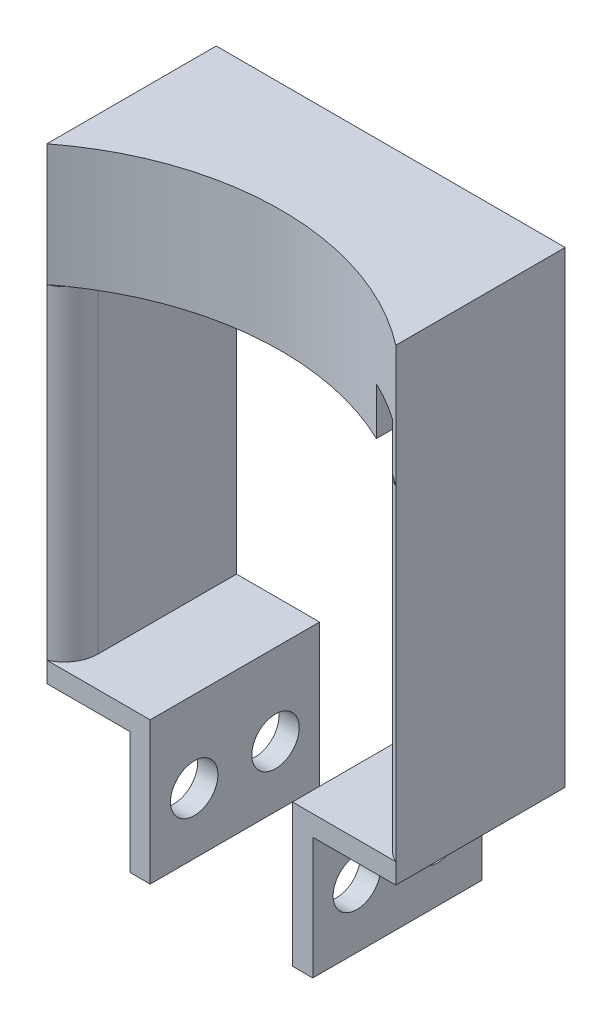
ISO-10303-21;
HEADER;
FILE_DESCRIPTION(('STEP AP214'),'2;1');
FILE_NAME('part.step','',(''),(''),'','','');
FILE_SCHEMA(('AUTOMOTIVE_DESIGN { 1 0 10303 214 1 1 1 1 }'));
ENDSEC;
DATA;
#1=APPLICATION_CONTEXT('core data for automotive mechanical design processes');
#2=APPLICATION_PROTOCOL_DEFINITION('international standard','automotive_design',2000,#1);
#3=PRODUCT_CONTEXT('',#1,'mechanical');
#4=PRODUCT('Part','Part','',(#3));
#5=PRODUCT_RELATED_PRODUCT_CATEGORY('part','',(#4));
#6=PRODUCT_DEFINITION_FORMATION('','',#4);
#7=PRODUCT_DEFINITION_CONTEXT('part definition',#1,'design');
#8=PRODUCT_DEFINITION('design','',#6,#7);
#9=PRODUCT_DEFINITION_SHAPE('','',#8);
#10=(LENGTH_UNIT() NAMED_UNIT(*) SI_UNIT(.MILLI.,.METRE.));
#11=(NAMED_UNIT(*) PLANE_ANGLE_UNIT() SI_UNIT($,.RADIAN.));
#12=(NAMED_UNIT(*) SI_UNIT($,.STERADIAN.) SOLID_ANGLE_UNIT());
#13=UNCERTAINTY_MEASURE_WITH_UNIT(LENGTH_MEASURE(1.E-05),#10,'distance_accuracy_value','');
#14=(GEOMETRIC_REPRESENTATION_CONTEXT(3) GLOBAL_UNCERTAINTY_ASSIGNED_CONTEXT((#13)) GLOBAL_UNIT_ASSIGNED_CONTEXT((#10,
#11,#12)) REPRESENTATION_CONTEXT('',''));
#15=CARTESIAN_POINT('',(0.,0.,0.));
#16=DIRECTION('',(0.,0.,1.));
#17=DIRECTION('',(1.,0.,0.));
#18=AXIS2_PLACEMENT_3D('',#15,#16,#17);
#19=CARTESIAN_POINT('',(0.,0.,25.));
#20=DIRECTION('',(0.,0.,1.));
#21=DIRECTION('',(1.,0.,0.));
#22=AXIS2_PLACEMENT_3D('',#19,#20,#21);
#23=PLANE('',#22);
#24=DIRECTION('',(0.,1.,0.));
#25=VECTOR('',#24,1.);
#26=CARTESIAN_POINT('',(28.,34.,25.));
#27=LINE('',#26,#25);
#28=CARTESIAN_POINT('',(28.,-27.,25.));
#29=VERTEX_POINT('',#28);
#30=CARTESIAN_POINT('',(28.,-24.,25.));
#31=VERTEX_POINT('',#30);
#32=EDGE_CURVE('E229',#29,#31,#27,.T.);
#33=ORIENTED_EDGE('',*,*,#32,.T.);
#34=DIRECTION('',(-1.,0.,0.));
#35=VECTOR('',#34,1.);
#36=CARTESIAN_POINT('',(25.,-24.,25.));
#37=LINE('',#36,#35);
#38=CARTESIAN_POINT('',(12.75,-24.,25.));
#39=VERTEX_POINT('',#38);
#40=EDGE_CURVE('E252',#31,#39,#37,.T.);
#41=ORIENTED_EDGE('',*,*,#40,.T.);
#42=DIRECTION('',(0.,-1.,0.));
#43=VECTOR('',#42,1.);
#44=CARTESIAN_POINT('',(12.75,-45.,25.));
#45=LINE('',#44,#43);
#46=CARTESIAN_POINT('',(12.75,-45.,25.));
#47=VERTEX_POINT('',#46);
#48=EDGE_CURVE('E249',#39,#47,#45,.T.);
#49=ORIENTED_EDGE('',*,*,#48,.T.);
#50=DIRECTION('',(1.,0.,0.));
#51=VECTOR('',#50,1.);
#52=CARTESIAN_POINT('',(15.75,-45.,25.));
#53=LINE('',#52,#51);
#54=CARTESIAN_POINT('',(15.75,-45.,25.));
#55=VERTEX_POINT('',#54);
#56=EDGE_CURVE('E246',#47,#55,#53,.T.);
#57=ORIENTED_EDGE('',*,*,#56,.T.);
#58=DIRECTION('',(0.,1.,0.));
#59=VECTOR('',#58,1.);
#60=CARTESIAN_POINT('',(15.75,-27.,25.));
#61=LINE('',#60,#59);
#62=CARTESIAN_POINT('',(15.75,-27.,25.));
#63=VERTEX_POINT('',#62);
#64=EDGE_CURVE('E243',#55,#63,#61,.T.);
#65=ORIENTED_EDGE('',*,*,#64,.T.);
#66=DIRECTION('',(1.,0.,0.));
#67=VECTOR('',#66,1.);
#68=CARTESIAN_POINT('',(28.,-27.,25.));
#69=LINE('',#68,#67);
#70=EDGE_CURVE('E239',#63,#29,#69,.T.);
#71=ORIENTED_EDGE('',*,*,#70,.T.);
#72=EDGE_LOOP('',(#33,#41,#49,#57,#65,#71));
#73=FACE_BOUND('',#72,.T.);
#74=ADVANCED_FACE('F45',(#73),#23,.T.);
#75=DIRECTION('',(-1.,0.,0.));
#76=VECTOR('',#75,1.);
#77=CARTESIAN_POINT('',(-20.5,-24.,25.));
#78=LINE('',#77,#76);
#79=CARTESIAN_POINT('',(-8.25,-24.,25.));
#80=VERTEX_POINT('',#79);
#81=CARTESIAN_POINT('',(-23.5,-24.,25.));
#82=VERTEX_POINT('',#81);
#83=EDGE_CURVE('E350',#80,#82,#78,.T.);
#84=ORIENTED_EDGE('',*,*,#83,.T.);
#85=DIRECTION('',(0.,-1.,0.));
#86=VECTOR('',#85,1.);
#87=CARTESIAN_POINT('',(-23.5,27.,25.));
#88=LINE('',#87,#86);
#89=CARTESIAN_POINT('',(-23.5,-27.,25.));
#90=VERTEX_POINT('',#89);
#91=EDGE_CURVE('E222',#82,#90,#88,.T.);
#92=ORIENTED_EDGE('',*,*,#91,.T.);
#93=DIRECTION('',(1.,0.,0.));
#94=VECTOR('',#93,1.);
#95=CARTESIAN_POINT('',(-23.5,-27.,25.));
#96=LINE('',#95,#94);
#97=CARTESIAN_POINT('',(-11.25,-27.,25.));
#98=VERTEX_POINT('',#97);
#99=EDGE_CURVE('E220',#90,#98,#96,.T.);
#100=ORIENTED_EDGE('',*,*,#99,.T.);
#101=DIRECTION('',(0.,-1.,0.));
#102=VECTOR('',#101,1.);
#103=CARTESIAN_POINT('',(-11.25,-27.,25.));
#104=LINE('',#103,#102);
#105=CARTESIAN_POINT('',(-11.25,-45.,25.));
#106=VERTEX_POINT('',#105);
#107=EDGE_CURVE('E225',#98,#106,#104,.T.);
#108=ORIENTED_EDGE('',*,*,#107,.T.);
#109=DIRECTION('',(1.,0.,0.));
#110=VECTOR('',#109,1.);
#111=CARTESIAN_POINT('',(-11.25,-45.,25.));
#112=LINE('',#111,#110);
#113=CARTESIAN_POINT('',(-8.25,-45.,25.));
#114=VERTEX_POINT('',#113);
#115=EDGE_CURVE('E367',#106,#114,#112,.T.);
#116=ORIENTED_EDGE('',*,*,#115,.T.);
#117=DIRECTION('',(0.,1.,0.));
#118=VECTOR('',#117,1.);
#119=CARTESIAN_POINT('',(-8.25,-24.,25.));
#120=LINE('',#119,#118);
#121=EDGE_CURVE('E386',#114,#80,#120,.T.);
#122=ORIENTED_EDGE('',*,*,#121,.T.);
#123=EDGE_LOOP('',(#84,#92,#100,#108,#116,#122));
#124=FACE_BOUND('',#123,.T.);
#125=ADVANCED_FACE('F364',(#124),#23,.T.);
#126=CARTESIAN_POINT('',(-20.5,24.,25.));
#127=DIRECTION('',(-1.,0.,0.));
#128=DIRECTION('',(0.,0.,1.));
#129=AXIS2_PLACEMENT_3D('',#126,#127,#128);
#130=PLANE('',#129);
#131=DIRECTION('',(0.,0.,-1.));
#132=VECTOR('',#131,1.);
#133=CARTESIAN_POINT('',(-20.5,24.,25.));
#134=LINE('',#133,#132);
#135=CARTESIAN_POINT('',(-20.5,24.,20.4174243050442));
#136=VERTEX_POINT('',#135);
#137=CARTESIAN_POINT('',(-20.5,24.,0.));
#138=VERTEX_POINT('',#137);
#139=EDGE_CURVE('E334',#136,#138,#134,.T.);
#140=ORIENTED_EDGE('',*,*,#139,.F.);
#141=DIRECTION('',(0.,1.,0.));
#142=VECTOR('',#141,1.);
#143=CARTESIAN_POINT('',(-20.5,24.,20.4174243050442));
#144=LINE('',#143,#142);
#145=CARTESIAN_POINT('',(-20.5,-24.,20.4174243050442));
#146=VERTEX_POINT('',#145);
#147=EDGE_CURVE('E62',#136,#146,#144,.F.);
#148=ORIENTED_EDGE('',*,*,#147,.T.);
#149=DIRECTION('',(0.,0.,-1.));
#150=VECTOR('',#149,1.);
#151=CARTESIAN_POINT('',(-20.5,-24.,25.));
#152=LINE('',#151,#150);
#153=CARTESIAN_POINT('',(-20.5,-24.,0.));
#154=VERTEX_POINT('',#153);
#155=EDGE_CURVE('E351',#146,#154,#152,.T.);
#156=ORIENTED_EDGE('',*,*,#155,.T.);
#157=DIRECTION('',(0.,1.,0.));
#158=VECTOR('',#157,1.);
#159=CARTESIAN_POINT('',(-20.5,24.,0.));
#160=LINE('',#159,#158);
#161=EDGE_CURVE('E260',#154,#138,#160,.T.);
#162=ORIENTED_EDGE('',*,*,#161,.T.);
#163=EDGE_LOOP('',(#140,#148,#156,#162));
#164=FACE_BOUND('',#163,.T.);
#165=ADVANCED_FACE('F339',(#164),#130,.F.);
#166=CARTESIAN_POINT('',(-20.5,24.,25.));
#167=DIRECTION('',(0.,1.,0.));
#168=DIRECTION('',(0.,0.,1.));
#169=AXIS2_PLACEMENT_3D('',#166,#167,#168);
#170=PLANE('',#169);
#171=DIRECTION('',(0.,0.,-1.));
#172=VECTOR('',#171,1.);
#173=CARTESIAN_POINT('',(20.5,24.,25.));
#174=LINE('',#173,#172);
#175=CARTESIAN_POINT('',(20.5,24.,20.3526437034143));
#176=VERTEX_POINT('',#175);
#177=CARTESIAN_POINT('',(20.5,24.,0.));
#178=VERTEX_POINT('',#177);
#179=EDGE_CURVE('E342',#176,#178,#174,.T.);
#180=ORIENTED_EDGE('',*,*,#179,.F.);
#181=CARTESIAN_POINT('',(2.25,24.,58.1803782377477));
#182=DIRECTION('',(0.,1.,0.));
#183=DIRECTION('',(0.,0.,1.));
#184=AXIS2_PLACEMENT_3D('',#181,#182,#183);
#185=CIRCLE('',#184,42.);
#186=CARTESIAN_POINT('',(-21.7240357492382,24.,23.694937688231));
#187=VERTEX_POINT('',#186);
#188=EDGE_CURVE('E296',#187,#176,#185,.F.);
#189=ORIENTED_EDGE('',*,*,#188,.F.);
#190=CARTESIAN_POINT('',(-25.5,24.,20.4174243050442));
#191=DIRECTION('',(0.,1.,0.));
#192=DIRECTION('',(0.,0.,1.));
#193=AXIS2_PLACEMENT_3D('',#190,#191,#192);
#194=CIRCLE('',#193,5.);
#195=EDGE_CURVE('E55',#187,#136,#194,.T.);
#196=ORIENTED_EDGE('',*,*,#195,.T.);
#197=ORIENTED_EDGE('',*,*,#139,.T.);
#198=DIRECTION('',(1.,0.,0.));
#199=VECTOR('',#198,1.);
#200=CARTESIAN_POINT('',(-20.5,24.,0.));
#201=LINE('',#200,#199);
#202=EDGE_CURVE('E395',#138,#178,#201,.T.);
#203=ORIENTED_EDGE('',*,*,#202,.T.);
#204=EDGE_LOOP('',(#180,#189,#196,#197,#203));
#205=FACE_BOUND('',#204,.T.);
#206=ADVANCED_FACE('F332',(#205),#170,.F.);
#207=CARTESIAN_POINT('',(20.5,24.,25.));
#208=DIRECTION('',(-1.,0.,0.));
#209=DIRECTION('',(0.,0.,1.));
#210=AXIS2_PLACEMENT_3D('',#207,#208,#209);
#211=PLANE('',#210);
#212=DIRECTION('',(0.,0.,-1.));
#213=VECTOR('',#212,1.);
#214=CARTESIAN_POINT('',(20.5,31.,25.));
#215=LINE('',#214,#213);
#216=CARTESIAN_POINT('',(20.5,31.,20.3526437034143));
#217=VERTEX_POINT('',#216);
#218=CARTESIAN_POINT('',(20.5,31.,0.));
#219=VERTEX_POINT('',#218);
#220=EDGE_CURVE('E483',#217,#219,#215,.T.);
#221=ORIENTED_EDGE('',*,*,#220,.F.);
#222=DIRECTION('',(0.,1.,0.));
#223=VECTOR('',#222,1.);
#224=CARTESIAN_POINT('',(20.5,-28.2497438082637,20.3526437034143));
#225=LINE('',#224,#223);
#226=EDGE_CURVE('E280',#217,#176,#225,.F.);
#227=ORIENTED_EDGE('',*,*,#226,.T.);
#228=ORIENTED_EDGE('',*,*,#179,.T.);
#229=DIRECTION('',(0.,1.,0.));
#230=VECTOR('',#229,1.);
#231=CARTESIAN_POINT('',(20.5,24.,0.));
#232=LINE('',#231,#230);
#233=EDGE_CURVE('E398',#178,#219,#232,.T.);
#234=ORIENTED_EDGE('',*,*,#233,.T.);
#235=EDGE_LOOP('',(#221,#227,#228,#234));
#236=FACE_BOUND('',#235,.T.);
#237=ADVANCED_FACE('F570',(#236),#211,.F.);
#238=CARTESIAN_POINT('',(20.5,31.,25.));
#239=DIRECTION('',(0.,1.,0.));
#240=DIRECTION('',(0.,0.,1.));
#241=AXIS2_PLACEMENT_3D('',#238,#239,#240);
#242=PLANE('',#241);
#243=DIRECTION('',(0.,0.,-1.));
#244=VECTOR('',#243,1.);
#245=CARTESIAN_POINT('',(25.,31.,25.));
#246=LINE('',#245,#244);
#247=CARTESIAN_POINT('',(25.,31.,20.4174243050442));
#248=VERTEX_POINT('',#247);
#249=CARTESIAN_POINT('',(25.,31.,0.));
#250=VERTEX_POINT('',#249);
#251=EDGE_CURVE('E480',#248,#250,#246,.T.);
#252=ORIENTED_EDGE('',*,*,#251,.F.);
#253=CARTESIAN_POINT('',(30.,31.,20.4174243050442));
#254=DIRECTION('',(0.,1.,0.));
#255=DIRECTION('',(0.,0.,1.));
#256=AXIS2_PLACEMENT_3D('',#253,#254,#255);
#257=CIRCLE('',#256,5.);
#258=CARTESIAN_POINT('',(26.2240357492382,31.,23.694937688231));
#259=VERTEX_POINT('',#258);
#260=EDGE_CURVE('E319',#248,#259,#257,.T.);
#261=ORIENTED_EDGE('',*,*,#260,.T.);
#262=CARTESIAN_POINT('',(2.25,31.,58.1803782377477));
#263=DIRECTION('',(0.,1.,0.));
#264=DIRECTION('',(0.,0.,1.));
#265=AXIS2_PLACEMENT_3D('',#262,#263,#264);
#266=CIRCLE('',#265,42.);
#267=EDGE_CURVE('E287',#259,#217,#266,.T.);
#268=ORIENTED_EDGE('',*,*,#267,.T.);
#269=ORIENTED_EDGE('',*,*,#220,.T.);
#270=DIRECTION('',(1.,0.,0.));
#271=VECTOR('',#270,1.);
#272=CARTESIAN_POINT('',(20.5,31.,0.));
#273=LINE('',#272,#271);
#274=EDGE_CURVE('E402',#219,#250,#273,.T.);
#275=ORIENTED_EDGE('',*,*,#274,.T.);
#276=EDGE_LOOP('',(#252,#261,#268,#269,#275));
#277=FACE_BOUND('',#276,.T.);
#278=ADVANCED_FACE('F566',(#277),#242,.F.);
#279=CARTESIAN_POINT('',(25.,31.,25.));
#280=DIRECTION('',(1.,0.,0.));
#281=DIRECTION('',(0.,0.,-1.));
#282=AXIS2_PLACEMENT_3D('',#279,#280,#281);
#283=PLANE('',#282);
#284=DIRECTION('',(0.,0.,-1.));
#285=VECTOR('',#284,1.);
#286=CARTESIAN_POINT('',(25.,-24.,25.));
#287=LINE('',#286,#285);
#288=CARTESIAN_POINT('',(25.,-24.,20.4174243050442));
#289=VERTEX_POINT('',#288);
#290=CARTESIAN_POINT('',(25.,-24.,0.));
#291=VERTEX_POINT('',#290);
#292=EDGE_CURVE('E477',#289,#291,#287,.T.);
#293=ORIENTED_EDGE('',*,*,#292,.F.);
#294=DIRECTION('',(0.,-1.,0.));
#295=VECTOR('',#294,1.);
#296=CARTESIAN_POINT('',(25.,31.,20.4174243050442));
#297=LINE('',#296,#295);
#298=EDGE_CURVE('E315',#289,#248,#297,.F.);
#299=ORIENTED_EDGE('',*,*,#298,.T.);
#300=ORIENTED_EDGE('',*,*,#251,.T.);
#301=DIRECTION('',(0.,-1.,0.));
#302=VECTOR('',#301,1.);
#303=CARTESIAN_POINT('',(25.,31.,0.));
#304=LINE('',#303,#302);
#305=EDGE_CURVE('E406',#250,#291,#304,.T.);
#306=ORIENTED_EDGE('',*,*,#305,.T.);
#307=EDGE_LOOP('',(#293,#299,#300,#306));
#308=FACE_BOUND('',#307,.T.);
#309=ADVANCED_FACE('F563',(#308),#283,.F.);
#310=CARTESIAN_POINT('',(25.,-24.,25.));
#311=DIRECTION('',(0.,-1.,0.));
#312=DIRECTION('',(0.,0.,-1.));
#313=AXIS2_PLACEMENT_3D('',#310,#311,#312);
#314=PLANE('',#313);
#315=DIRECTION('',(-1.,0.,0.));
#316=VECTOR('',#315,1.);
#317=CARTESIAN_POINT('',(25.,-24.,0.));
#318=LINE('',#317,#316);
#319=CARTESIAN_POINT('',(12.75,-24.,0.));
#320=VERTEX_POINT('',#319);
#321=EDGE_CURVE('E410',#291,#320,#318,.T.);
#322=ORIENTED_EDGE('',*,*,#321,.T.);
#323=DIRECTION('',(0.,0.,-1.));
#324=VECTOR('',#323,1.);
#325=CARTESIAN_POINT('',(12.75,-24.,25.));
#326=LINE('',#325,#324);
#327=EDGE_CURVE('E473',#39,#320,#326,.T.);
#328=ORIENTED_EDGE('',*,*,#327,.F.);
#329=ORIENTED_EDGE('',*,*,#40,.F.);
#330=CARTESIAN_POINT('',(30.,-24.,20.4174243050442));
#331=DIRECTION('',(0.,-1.,0.));
#332=DIRECTION('',(0.,0.,-1.));
#333=AXIS2_PLACEMENT_3D('',#330,#331,#332);
#334=CIRCLE('',#333,5.);
#335=EDGE_CURVE('E314',#31,#289,#334,.T.);
#336=ORIENTED_EDGE('',*,*,#335,.T.);
#337=ORIENTED_EDGE('',*,*,#292,.T.);
#338=EDGE_LOOP('',(#322,#328,#329,#336,#337));
#339=FACE_BOUND('',#338,.T.);
#340=ADVANCED_FACE('F559',(#339),#314,.F.);
#341=CARTESIAN_POINT('',(12.75,-45.,25.));
#342=DIRECTION('',(1.,0.,0.));
#343=DIRECTION('',(0.,0.,-1.));
#344=AXIS2_PLACEMENT_3D('',#341,#342,#343);
#345=PLANE('',#344);
#346=CARTESIAN_POINT('',(12.75,-36.,6.5));
#347=DIRECTION('',(1.,0.,0.));
#348=DIRECTION('',(0.,0.,-1.));
#349=AXIS2_PLACEMENT_3D('',#346,#347,#348);
#350=CIRCLE('',#349,3.5);
#351=CARTESIAN_POINT('',(12.75,-36.,3.));
#352=VERTEX_POINT('',#351);
#353=EDGE_CURVE('E256',#352,#352,#350,.F.);
#354=ORIENTED_EDGE('',*,*,#353,.F.);
#355=EDGE_LOOP('',(#354));
#356=FACE_BOUND('',#355,.T.);
#357=CARTESIAN_POINT('',(12.75,-36.,18.5));
#358=DIRECTION('',(1.,0.,0.));
#359=DIRECTION('',(0.,0.,-1.));
#360=AXIS2_PLACEMENT_3D('',#357,#358,#359);
#361=CIRCLE('',#360,3.5);
#362=CARTESIAN_POINT('',(12.75,-36.,15.));
#363=VERTEX_POINT('',#362);
#364=EDGE_CURVE('E266',#363,#363,#361,.F.);
#365=ORIENTED_EDGE('',*,*,#364,.F.);
#366=EDGE_LOOP('',(#365));
#367=FACE_BOUND('',#366,.T.);
#368=DIRECTION('',(0.,-1.,0.));
#369=VECTOR('',#368,1.);
#370=CARTESIAN_POINT('',(12.75,-45.,0.));
#371=LINE('',#370,#369);
#372=CARTESIAN_POINT('',(12.75,-45.,0.));
#373=VERTEX_POINT('',#372);
#374=EDGE_CURVE('E413',#320,#373,#371,.T.);
#375=ORIENTED_EDGE('',*,*,#374,.T.);
#376=DIRECTION('',(0.,0.,-1.));
#377=VECTOR('',#376,1.);
#378=CARTESIAN_POINT('',(12.75,-45.,25.));
#379=LINE('',#378,#377);
#380=EDGE_CURVE('E469',#47,#373,#379,.T.);
#381=ORIENTED_EDGE('',*,*,#380,.F.);
#382=ORIENTED_EDGE('',*,*,#48,.F.);
#383=ORIENTED_EDGE('',*,*,#327,.T.);
#384=EDGE_LOOP('',(#375,#381,#382,#383));
#385=FACE_BOUND('',#384,.T.);
#386=ADVANCED_FACE('F555',(#356,#367,#385),#345,.F.);
#387=CARTESIAN_POINT('',(15.75,-45.,25.));
#388=DIRECTION('',(0.,1.,0.));
#389=DIRECTION('',(0.,0.,1.));
#390=AXIS2_PLACEMENT_3D('',#387,#388,#389);
#391=PLANE('',#390);
#392=DIRECTION('',(1.,0.,0.));
#393=VECTOR('',#392,1.);
#394=CARTESIAN_POINT('',(15.75,-45.,0.));
#395=LINE('',#394,#393);
#396=CARTESIAN_POINT('',(15.75,-45.,0.));
#397=VERTEX_POINT('',#396);
#398=EDGE_CURVE('E416',#373,#397,#395,.T.);
#399=ORIENTED_EDGE('',*,*,#398,.T.);
#400=DIRECTION('',(0.,0.,-1.));
#401=VECTOR('',#400,1.);
#402=CARTESIAN_POINT('',(15.75,-45.,25.));
#403=LINE('',#402,#401);
#404=EDGE_CURVE('E465',#55,#397,#403,.T.);
#405=ORIENTED_EDGE('',*,*,#404,.F.);
#406=ORIENTED_EDGE('',*,*,#56,.F.);
#407=ORIENTED_EDGE('',*,*,#380,.T.);
#408=EDGE_LOOP('',(#399,#405,#406,#407));
#409=FACE_BOUND('',#408,.T.);
#410=ADVANCED_FACE('F551',(#409),#391,.F.);
#411=CARTESIAN_POINT('',(15.75,-27.,25.));
#412=DIRECTION('',(-1.,0.,0.));
#413=DIRECTION('',(0.,0.,1.));
#414=AXIS2_PLACEMENT_3D('',#411,#412,#413);
#415=PLANE('',#414);
#416=CARTESIAN_POINT('',(15.75,-36.,6.5));
#417=DIRECTION('',(-1.,0.,0.));
#418=DIRECTION('',(0.,0.,1.));
#419=AXIS2_PLACEMENT_3D('',#416,#417,#418);
#420=CIRCLE('',#419,3.5);
#421=CARTESIAN_POINT('',(15.75,-36.,10.));
#422=VERTEX_POINT('',#421);
#423=EDGE_CURVE('E261',#422,#422,#420,.F.);
#424=ORIENTED_EDGE('',*,*,#423,.F.);
#425=EDGE_LOOP('',(#424));
#426=FACE_BOUND('',#425,.T.);
#427=CARTESIAN_POINT('',(15.75,-36.,18.5));
#428=DIRECTION('',(-1.,0.,0.));
#429=DIRECTION('',(0.,0.,1.));
#430=AXIS2_PLACEMENT_3D('',#427,#428,#429);
#431=CIRCLE('',#430,3.5);
#432=CARTESIAN_POINT('',(15.75,-36.,22.));
#433=VERTEX_POINT('',#432);
#434=EDGE_CURVE('E270',#433,#433,#431,.F.);
#435=ORIENTED_EDGE('',*,*,#434,.F.);
#436=EDGE_LOOP('',(#435));
#437=FACE_BOUND('',#436,.T.);
#438=DIRECTION('',(0.,1.,0.));
#439=VECTOR('',#438,1.);
#440=CARTESIAN_POINT('',(15.75,-27.,0.));
#441=LINE('',#440,#439);
#442=CARTESIAN_POINT('',(15.75,-27.,0.));
#443=VERTEX_POINT('',#442);
#444=EDGE_CURVE('E419',#397,#443,#441,.T.);
#445=ORIENTED_EDGE('',*,*,#444,.T.);
#446=DIRECTION('',(0.,0.,-1.));
#447=VECTOR('',#446,1.);
#448=CARTESIAN_POINT('',(15.75,-27.,25.));
#449=LINE('',#448,#447);
#450=EDGE_CURVE('E461',#63,#443,#449,.T.);
#451=ORIENTED_EDGE('',*,*,#450,.F.);
#452=ORIENTED_EDGE('',*,*,#64,.F.);
#453=ORIENTED_EDGE('',*,*,#404,.T.);
#454=EDGE_LOOP('',(#445,#451,#452,#453));
#455=FACE_BOUND('',#454,.T.);
#456=ADVANCED_FACE('F547',(#426,#437,#455),#415,.F.);
#457=CARTESIAN_POINT('',(28.,-27.,25.));
#458=DIRECTION('',(0.,1.,0.));
#459=DIRECTION('',(0.,0.,1.));
#460=AXIS2_PLACEMENT_3D('',#457,#458,#459);
#461=PLANE('',#460);
#462=DIRECTION('',(1.,0.,0.));
#463=VECTOR('',#462,1.);
#464=CARTESIAN_POINT('',(28.,-27.,0.));
#465=LINE('',#464,#463);
#466=CARTESIAN_POINT('',(28.,-27.,0.));
#467=VERTEX_POINT('',#466);
#468=EDGE_CURVE('E422',#443,#467,#465,.T.);
#469=ORIENTED_EDGE('',*,*,#468,.T.);
#470=DIRECTION('',(0.,0.,-1.));
#471=VECTOR('',#470,1.);
#472=CARTESIAN_POINT('',(28.,-27.,25.));
#473=LINE('',#472,#471);
#474=EDGE_CURVE('E457',#29,#467,#473,.T.);
#475=ORIENTED_EDGE('',*,*,#474,.F.);
#476=ORIENTED_EDGE('',*,*,#70,.F.);
#477=ORIENTED_EDGE('',*,*,#450,.T.);
#478=EDGE_LOOP('',(#469,#475,#476,#477));
#479=FACE_BOUND('',#478,.T.);
#480=ADVANCED_FACE('F544',(#479),#461,.F.);
#481=CARTESIAN_POINT('',(28.,42.,25.));
#482=DIRECTION('',(-1.,0.,0.));
#483=DIRECTION('',(0.,0.,1.));
#484=AXIS2_PLACEMENT_3D('',#481,#482,#483);
#485=PLANE('',#484);
#486=DIRECTION('',(0.,1.,0.));
#487=VECTOR('',#486,1.);
#488=CARTESIAN_POINT('',(28.,42.,0.));
#489=LINE('',#488,#487);
#490=CARTESIAN_POINT('',(28.,42.,0.));
#491=VERTEX_POINT('',#490);
#492=EDGE_CURVE('E426',#467,#491,#489,.T.);
#493=ORIENTED_EDGE('',*,*,#492,.T.);
#494=DIRECTION('',(0.,0.,-1.));
#495=VECTOR('',#494,1.);
#496=CARTESIAN_POINT('',(28.,42.,25.));
#497=LINE('',#496,#495);
#498=CARTESIAN_POINT('',(28.,42.,25.));
#499=VERTEX_POINT('',#498);
#500=EDGE_CURVE('E211',#499,#491,#497,.T.);
#501=ORIENTED_EDGE('',*,*,#500,.F.);
#502=DIRECTION('',(0.,1.,0.));
#503=VECTOR('',#502,1.);
#504=CARTESIAN_POINT('',(28.,-28.2497438082637,25.));
#505=LINE('',#504,#503);
#506=CARTESIAN_POINT('',(28.,24.,25.));
#507=VERTEX_POINT('',#506);
#508=EDGE_CURVE('E197',#507,#499,#505,.T.);
#509=ORIENTED_EDGE('',*,*,#508,.F.);
#510=EDGE_CURVE('E234',#31,#507,#27,.T.);
#511=ORIENTED_EDGE('',*,*,#510,.F.);
#512=ORIENTED_EDGE('',*,*,#32,.F.);
#513=ORIENTED_EDGE('',*,*,#474,.T.);
#514=EDGE_LOOP('',(#493,#501,#509,#511,#512,#513));
#515=FACE_BOUND('',#514,.T.);
#516=ADVANCED_FACE('F307',(#515),#485,.F.);
#517=CARTESIAN_POINT('',(-23.5,42.,25.));
#518=DIRECTION('',(0.,-1.,0.));
#519=DIRECTION('',(0.,0.,-1.));
#520=AXIS2_PLACEMENT_3D('',#517,#518,#519);
#521=PLANE('',#520);
#522=DIRECTION('',(0.,0.,-1.));
#523=VECTOR('',#522,1.);
#524=CARTESIAN_POINT('',(-23.5,42.,25.));
#525=LINE('',#524,#523);
#526=CARTESIAN_POINT('',(-23.5,42.,25.));
#527=VERTEX_POINT('',#526);
#528=CARTESIAN_POINT('',(-23.5,42.,0.));
#529=VERTEX_POINT('',#528);
#530=EDGE_CURVE('E205',#527,#529,#525,.T.);
#531=ORIENTED_EDGE('',*,*,#530,.F.);
#532=CARTESIAN_POINT('',(2.25,42.,58.1803782377477));
#533=DIRECTION('',(0.,1.,0.));
#534=DIRECTION('',(0.,0.,-1.));
#535=AXIS2_PLACEMENT_3D('',#532,#533,#534);
#536=CIRCLE('',#535,42.);
#537=EDGE_CURVE('E188',#499,#527,#536,.T.);
#538=ORIENTED_EDGE('',*,*,#537,.F.);
#539=ORIENTED_EDGE('',*,*,#500,.T.);
#540=DIRECTION('',(-1.,0.,0.));
#541=VECTOR('',#540,1.);
#542=CARTESIAN_POINT('',(-23.5,42.,0.));
#543=LINE('',#542,#541);
#544=EDGE_CURVE('E208',#491,#529,#543,.T.);
#545=ORIENTED_EDGE('',*,*,#544,.T.);
#546=EDGE_LOOP('',(#531,#538,#539,#545));
#547=FACE_BOUND('',#546,.T.);
#548=ADVANCED_FACE('F206',(#547),#521,.F.);
#549=CARTESIAN_POINT('',(-23.5,27.,25.));
#550=DIRECTION('',(1.,0.,0.));
#551=DIRECTION('',(0.,0.,-1.));
#552=AXIS2_PLACEMENT_3D('',#549,#550,#551);
#553=PLANE('',#552);
#554=DIRECTION('',(0.,-1.,0.));
#555=VECTOR('',#554,1.);
#556=CARTESIAN_POINT('',(-23.5,27.,0.));
#557=LINE('',#556,#555);
#558=CARTESIAN_POINT('',(-23.5,-27.,0.));
#559=VERTEX_POINT('',#558);
#560=EDGE_CURVE('E354',#529,#559,#557,.T.);
#561=ORIENTED_EDGE('',*,*,#560,.T.);
#562=DIRECTION('',(0.,0.,-1.));
#563=VECTOR('',#562,1.);
#564=CARTESIAN_POINT('',(-23.5,-27.,25.));
#565=LINE('',#564,#563);
#566=EDGE_CURVE('E212',#90,#559,#565,.T.);
#567=ORIENTED_EDGE('',*,*,#566,.F.);
#568=ORIENTED_EDGE('',*,*,#91,.F.);
#569=CARTESIAN_POINT('',(-23.5,24.,25.));
#570=VERTEX_POINT('',#569);
#571=EDGE_CURVE('E218',#570,#82,#88,.T.);
#572=ORIENTED_EDGE('',*,*,#571,.F.);
#573=EDGE_CURVE('E193',#527,#570,#88,.T.);
#574=ORIENTED_EDGE('',*,*,#573,.F.);
#575=ORIENTED_EDGE('',*,*,#530,.T.);
#576=EDGE_LOOP('',(#561,#567,#568,#572,#574,#575));
#577=FACE_BOUND('',#576,.T.);
#578=ADVANCED_FACE('F215',(#577),#553,.F.);
#579=CARTESIAN_POINT('',(-23.5,-27.,25.));
#580=DIRECTION('',(0.,1.,0.));
#581=DIRECTION('',(-1.,0.,0.));
#582=AXIS2_PLACEMENT_3D('',#579,#580,#581);
#583=PLANE('',#582);
#584=DIRECTION('',(1.,0.,0.));
#585=VECTOR('',#584,1.);
#586=CARTESIAN_POINT('',(-23.5,-27.,0.));
#587=LINE('',#586,#585);
#588=CARTESIAN_POINT('',(-11.25,-27.,0.));
#589=VERTEX_POINT('',#588);
#590=EDGE_CURVE('E433',#559,#589,#587,.T.);
#591=ORIENTED_EDGE('',*,*,#590,.T.);
#592=DIRECTION('',(0.,0.,-1.));
#593=VECTOR('',#592,1.);
#594=CARTESIAN_POINT('',(-11.25,-27.,25.));
#595=LINE('',#594,#593);
#596=EDGE_CURVE('E358',#98,#589,#595,.T.);
#597=ORIENTED_EDGE('',*,*,#596,.F.);
#598=ORIENTED_EDGE('',*,*,#99,.F.);
#599=ORIENTED_EDGE('',*,*,#566,.T.);
#600=EDGE_LOOP('',(#591,#597,#598,#599));
#601=FACE_BOUND('',#600,.T.);
#602=ADVANCED_FACE('F361',(#601),#583,.F.);
#603=CARTESIAN_POINT('',(-11.25,-27.,25.));
#604=DIRECTION('',(1.,0.,0.));
#605=DIRECTION('',(0.,0.,-1.));
#606=AXIS2_PLACEMENT_3D('',#603,#604,#605);
#607=PLANE('',#606);
#608=CARTESIAN_POINT('',(-11.25,-36.,6.5));
#609=DIRECTION('',(1.,0.,0.));
#610=DIRECTION('',(0.,0.,-1.));
#611=AXIS2_PLACEMENT_3D('',#608,#609,#610);
#612=CIRCLE('',#611,3.5);
#613=CARTESIAN_POINT('',(-11.25,-36.,3.));
#614=VERTEX_POINT('',#613);
#615=EDGE_CURVE('E279',#614,#614,#612,.T.);
#616=ORIENTED_EDGE('',*,*,#615,.T.);
#617=EDGE_LOOP('',(#616));
#618=FACE_BOUND('',#617,.T.);
#619=CARTESIAN_POINT('',(-11.25,-36.,18.5));
#620=DIRECTION('',(1.,0.,0.));
#621=DIRECTION('',(0.,0.,1.));
#622=AXIS2_PLACEMENT_3D('',#619,#620,#621);
#623=CIRCLE('',#622,3.5);
#624=CARTESIAN_POINT('',(-11.25,-36.,22.));
#625=VERTEX_POINT('',#624);
#626=EDGE_CURVE('E275',#625,#625,#623,.T.);
#627=ORIENTED_EDGE('',*,*,#626,.T.);
#628=EDGE_LOOP('',(#627));
#629=FACE_BOUND('',#628,.T.);
#630=DIRECTION('',(0.,-1.,0.));
#631=VECTOR('',#630,1.);
#632=CARTESIAN_POINT('',(-11.25,-27.,0.));
#633=LINE('',#632,#631);
#634=CARTESIAN_POINT('',(-11.25,-45.,0.));
#635=VERTEX_POINT('',#634);
#636=EDGE_CURVE('E376',#589,#635,#633,.T.);
#637=ORIENTED_EDGE('',*,*,#636,.T.);
#638=DIRECTION('',(0.,0.,-1.));
#639=VECTOR('',#638,1.);
#640=CARTESIAN_POINT('',(-11.25,-45.,25.));
#641=LINE('',#640,#639);
#642=EDGE_CURVE('E373',#106,#635,#641,.T.);
#643=ORIENTED_EDGE('',*,*,#642,.F.);
#644=ORIENTED_EDGE('',*,*,#107,.F.);
#645=ORIENTED_EDGE('',*,*,#596,.T.);
#646=EDGE_LOOP('',(#637,#643,#644,#645));
#647=FACE_BOUND('',#646,.T.);
#648=ADVANCED_FACE('F374',(#618,#629,#647),#607,.F.);
#649=CARTESIAN_POINT('',(-11.25,-45.,25.));
#650=DIRECTION('',(0.,1.,0.));
#651=DIRECTION('',(0.,0.,1.));
#652=AXIS2_PLACEMENT_3D('',#649,#650,#651);
#653=PLANE('',#652);
#654=DIRECTION('',(1.,0.,0.));
#655=VECTOR('',#654,1.);
#656=CARTESIAN_POINT('',(-11.25,-45.,0.));
#657=LINE('',#656,#655);
#658=CARTESIAN_POINT('',(-8.25,-45.,0.));
#659=VERTEX_POINT('',#658);
#660=EDGE_CURVE('E438',#635,#659,#657,.T.);
#661=ORIENTED_EDGE('',*,*,#660,.T.);
#662=DIRECTION('',(0.,0.,-1.));
#663=VECTOR('',#662,1.);
#664=CARTESIAN_POINT('',(-8.25,-45.,25.));
#665=LINE('',#664,#663);
#666=EDGE_CURVE('E380',#114,#659,#665,.T.);
#667=ORIENTED_EDGE('',*,*,#666,.F.);
#668=ORIENTED_EDGE('',*,*,#115,.F.);
#669=ORIENTED_EDGE('',*,*,#642,.T.);
#670=EDGE_LOOP('',(#661,#667,#668,#669));
#671=FACE_BOUND('',#670,.T.);
#672=ADVANCED_FACE('F382',(#671),#653,.F.);
#673=CARTESIAN_POINT('',(-8.25,-24.,25.));
#674=DIRECTION('',(-1.,0.,0.));
#675=DIRECTION('',(0.,-1.,0.));
#676=AXIS2_PLACEMENT_3D('',#673,#674,#675);
#677=PLANE('',#676);
#678=CARTESIAN_POINT('',(-8.25,-36.,6.5));
#679=DIRECTION('',(-1.,0.,0.));
#680=DIRECTION('',(0.,-1.,0.));
#681=AXIS2_PLACEMENT_3D('',#678,#679,#680);
#682=CIRCLE('',#681,3.5);
#683=CARTESIAN_POINT('',(-8.25,-39.5,6.5));
#684=VERTEX_POINT('',#683);
#685=EDGE_CURVE('E265',#684,#684,#682,.F.);
#686=ORIENTED_EDGE('',*,*,#685,.F.);
#687=EDGE_LOOP('',(#686));
#688=FACE_BOUND('',#687,.T.);
#689=CARTESIAN_POINT('',(-8.25,-36.,18.5));
#690=DIRECTION('',(-1.,0.,0.));
#691=DIRECTION('',(0.,-1.,0.));
#692=AXIS2_PLACEMENT_3D('',#689,#690,#691);
#693=CIRCLE('',#692,3.5);
#694=CARTESIAN_POINT('',(-8.25,-39.5,18.5));
#695=VERTEX_POINT('',#694);
#696=EDGE_CURVE('E274',#695,#695,#693,.F.);
#697=ORIENTED_EDGE('',*,*,#696,.F.);
#698=EDGE_LOOP('',(#697));
#699=FACE_BOUND('',#698,.T.);
#700=DIRECTION('',(0.,1.,0.));
#701=VECTOR('',#700,1.);
#702=CARTESIAN_POINT('',(-8.25,-24.,0.));
#703=LINE('',#702,#701);
#704=CARTESIAN_POINT('',(-8.25,-24.,0.));
#705=VERTEX_POINT('',#704);
#706=EDGE_CURVE('E441',#659,#705,#703,.T.);
#707=ORIENTED_EDGE('',*,*,#706,.T.);
#708=DIRECTION('',(0.,0.,-1.));
#709=VECTOR('',#708,1.);
#710=CARTESIAN_POINT('',(-8.25,-24.,25.));
#711=LINE('',#710,#709);
#712=EDGE_CURVE('E448',#80,#705,#711,.T.);
#713=ORIENTED_EDGE('',*,*,#712,.F.);
#714=ORIENTED_EDGE('',*,*,#121,.F.);
#715=ORIENTED_EDGE('',*,*,#666,.T.);
#716=EDGE_LOOP('',(#707,#713,#714,#715));
#717=FACE_BOUND('',#716,.T.);
#718=ADVANCED_FACE('F528',(#688,#699,#717),#677,.F.);
#719=CARTESIAN_POINT('',(-20.5,-24.,25.));
#720=DIRECTION('',(0.,-1.,0.));
#721=DIRECTION('',(1.,0.,0.));
#722=AXIS2_PLACEMENT_3D('',#719,#720,#721);
#723=PLANE('',#722);
#724=DIRECTION('',(-1.,0.,0.));
#725=VECTOR('',#724,1.);
#726=CARTESIAN_POINT('',(-20.5,-24.,0.));
#727=LINE('',#726,#725);
#728=EDGE_CURVE('E255',#705,#154,#727,.T.);
#729=ORIENTED_EDGE('',*,*,#728,.T.);
#730=ORIENTED_EDGE('',*,*,#155,.F.);
#731=CARTESIAN_POINT('',(-25.5,-24.,20.4174243050442));
#732=DIRECTION('',(0.,-1.,0.));
#733=DIRECTION('',(1.,0.,0.));
#734=AXIS2_PLACEMENT_3D('',#731,#732,#733);
#735=CIRCLE('',#734,5.);
#736=EDGE_CURVE('E11',#146,#82,#735,.T.);
#737=ORIENTED_EDGE('',*,*,#736,.T.);
#738=ORIENTED_EDGE('',*,*,#83,.F.);
#739=ORIENTED_EDGE('',*,*,#712,.T.);
#740=EDGE_LOOP('',(#729,#730,#737,#738,#739));
#741=FACE_BOUND('',#740,.T.);
#742=ADVANCED_FACE('F348',(#741),#723,.F.);
#743=CARTESIAN_POINT('',(0.,0.,0.));
#744=DIRECTION('',(0.,0.,1.));
#745=DIRECTION('',(1.,0.,0.));
#746=AXIS2_PLACEMENT_3D('',#743,#744,#745);
#747=PLANE('',#746);
#748=ORIENTED_EDGE('',*,*,#161,.F.);
#749=ORIENTED_EDGE('',*,*,#728,.F.);
#750=ORIENTED_EDGE('',*,*,#706,.F.);
#751=ORIENTED_EDGE('',*,*,#660,.F.);
#752=ORIENTED_EDGE('',*,*,#636,.F.);
#753=ORIENTED_EDGE('',*,*,#590,.F.);
#754=ORIENTED_EDGE('',*,*,#560,.F.);
#755=ORIENTED_EDGE('',*,*,#544,.F.);
#756=ORIENTED_EDGE('',*,*,#492,.F.);
#757=ORIENTED_EDGE('',*,*,#468,.F.);
#758=ORIENTED_EDGE('',*,*,#444,.F.);
#759=ORIENTED_EDGE('',*,*,#398,.F.);
#760=ORIENTED_EDGE('',*,*,#374,.F.);
#761=ORIENTED_EDGE('',*,*,#321,.F.);
#762=ORIENTED_EDGE('',*,*,#305,.F.);
#763=ORIENTED_EDGE('',*,*,#274,.F.);
#764=ORIENTED_EDGE('',*,*,#233,.F.);
#765=ORIENTED_EDGE('',*,*,#202,.F.);
#766=EDGE_LOOP('',(#748,#749,#750,#751,#752,#753,#754,#755,#756,#757,#758,#759,#760,#761,#762,
#763,#764,#765));
#767=FACE_BOUND('',#766,.T.);
#768=ADVANCED_FACE('F521',(#767),#747,.F.);
#769=CARTESIAN_POINT('',(28.,-36.,18.5));
#770=DIRECTION('',(-1.,0.,0.));
#771=DIRECTION('',(0.,0.,1.));
#772=AXIS2_PLACEMENT_3D('',#769,#770,#771);
#773=CYLINDRICAL_SURFACE('',#772,3.5);
#774=ORIENTED_EDGE('',*,*,#626,.F.);
#775=EDGE_LOOP('',(#774));
#776=FACE_BOUND('',#775,.T.);
#777=ORIENTED_EDGE('',*,*,#696,.T.);
#778=EDGE_LOOP('',(#777));
#779=FACE_BOUND('',#778,.T.);
#780=ADVANCED_FACE('F524',(#776,#779),#773,.F.);
#781=CARTESIAN_POINT('',(28.,-36.,6.5));
#782=DIRECTION('',(-1.,0.,0.));
#783=DIRECTION('',(0.,0.,1.));
#784=AXIS2_PLACEMENT_3D('',#781,#782,#783);
#785=CYLINDRICAL_SURFACE('',#784,3.5);
#786=ORIENTED_EDGE('',*,*,#615,.F.);
#787=EDGE_LOOP('',(#786));
#788=FACE_BOUND('',#787,.T.);
#789=ORIENTED_EDGE('',*,*,#685,.T.);
#790=EDGE_LOOP('',(#789));
#791=FACE_BOUND('',#790,.T.);
#792=ADVANCED_FACE('F628',(#788,#791),#785,.F.);
#793=ORIENTED_EDGE('',*,*,#434,.T.);
#794=EDGE_LOOP('',(#793));
#795=FACE_BOUND('',#794,.T.);
#796=ORIENTED_EDGE('',*,*,#364,.T.);
#797=EDGE_LOOP('',(#796));
#798=FACE_BOUND('',#797,.T.);
#799=ADVANCED_FACE('F519',(#795,#798),#773,.F.);
#800=ORIENTED_EDGE('',*,*,#423,.T.);
#801=EDGE_LOOP('',(#800));
#802=FACE_BOUND('',#801,.T.);
#803=ORIENTED_EDGE('',*,*,#353,.T.);
#804=EDGE_LOOP('',(#803));
#805=FACE_BOUND('',#804,.T.);
#806=ADVANCED_FACE('F509',(#802,#805),#785,.F.);
#807=CARTESIAN_POINT('',(2.25,-28.2497438082637,58.1803782377477));
#808=DIRECTION('',(0.,1.,0.));
#809=DIRECTION('',(0.,0.,1.));
#810=AXIS2_PLACEMENT_3D('',#807,#808,#809);
#811=CYLINDRICAL_SURFACE('',#810,42.);
#812=ORIENTED_EDGE('',*,*,#267,.F.);
#813=DIRECTION('',(0.,1.,0.));
#814=VECTOR('',#813,1.);
#815=CARTESIAN_POINT('',(26.2240357492382,31.,23.694937688231));
#816=LINE('',#815,#814);
#817=CARTESIAN_POINT('',(26.2240357492384,24.,23.6949376882311));
#818=VERTEX_POINT('',#817);
#819=EDGE_CURVE('E302',#259,#818,#816,.F.);
#820=ORIENTED_EDGE('',*,*,#819,.T.);
#821=EDGE_CURVE('E293',#818,#507,#185,.F.);
#822=ORIENTED_EDGE('',*,*,#821,.T.);
#823=ORIENTED_EDGE('',*,*,#508,.T.);
#824=ORIENTED_EDGE('',*,*,#537,.T.);
#825=ORIENTED_EDGE('',*,*,#573,.T.);
#826=EDGE_CURVE('E291',#570,#187,#185,.F.);
#827=ORIENTED_EDGE('',*,*,#826,.T.);
#828=ORIENTED_EDGE('',*,*,#188,.T.);
#829=ORIENTED_EDGE('',*,*,#226,.F.);
#830=EDGE_LOOP('',(#812,#820,#822,#823,#824,#825,#827,#828,#829));
#831=FACE_BOUND('',#830,.T.);
#832=ADVANCED_FACE('F190',(#831),#811,.F.);
#833=CARTESIAN_POINT('',(-20.5,24.,25.));
#834=DIRECTION('',(0.,1.,0.));
#835=DIRECTION('',(0.,0.,1.));
#836=AXIS2_PLACEMENT_3D('',#833,#834,#835);
#837=PLANE('',#836);
#838=ORIENTED_EDGE('',*,*,#826,.F.);
#839=CARTESIAN_POINT('',(-25.5,24.,20.4174243050442));
#840=DIRECTION('',(0.,1.,0.));
#841=DIRECTION('',(0.,0.,1.));
#842=AXIS2_PLACEMENT_3D('',#839,#840,#841);
#843=CIRCLE('',#842,5.);
#844=EDGE_CURVE('E325',#570,#187,#843,.T.);
#845=ORIENTED_EDGE('',*,*,#844,.T.);
#846=EDGE_LOOP('',(#838,#845));
#847=FACE_BOUND('',#846,.T.);
#848=ADVANCED_FACE('F501',(#847),#837,.T.);
#849=ORIENTED_EDGE('',*,*,#821,.F.);
#850=CARTESIAN_POINT('',(30.,24.,20.4174243050442));
#851=DIRECTION('',(0.,1.,0.));
#852=DIRECTION('',(0.,0.,1.));
#853=AXIS2_PLACEMENT_3D('',#850,#851,#852);
#854=CIRCLE('',#853,5.);
#855=EDGE_CURVE('E312',#818,#507,#854,.T.);
#856=ORIENTED_EDGE('',*,*,#855,.T.);
#857=EDGE_LOOP('',(#849,#856));
#858=FACE_BOUND('',#857,.T.);
#859=ADVANCED_FACE('F503',(#858),#837,.T.);
#860=CARTESIAN_POINT('',(30.,0.,20.4174243050442));
#861=DIRECTION('',(0.,-1.,0.));
#862=DIRECTION('',(0.,0.,-1.));
#863=AXIS2_PLACEMENT_3D('',#860,#861,#862);
#864=CYLINDRICAL_SURFACE('',#863,5.);
#865=ORIENTED_EDGE('',*,*,#260,.F.);
#866=ORIENTED_EDGE('',*,*,#298,.F.);
#867=ORIENTED_EDGE('',*,*,#335,.F.);
#868=ORIENTED_EDGE('',*,*,#510,.T.);
#869=ORIENTED_EDGE('',*,*,#855,.F.);
#870=ORIENTED_EDGE('',*,*,#819,.F.);
#871=EDGE_LOOP('',(#865,#866,#867,#868,#869,#870));
#872=FACE_BOUND('',#871,.T.);
#873=ADVANCED_FACE('F311',(#872),#864,.T.);
#874=CARTESIAN_POINT('',(-25.5,0.,20.4174243050442));
#875=DIRECTION('',(0.,1.,0.));
#876=DIRECTION('',(0.,0.,1.));
#877=AXIS2_PLACEMENT_3D('',#874,#875,#876);
#878=CYLINDRICAL_SURFACE('',#877,5.);
#879=ORIENTED_EDGE('',*,*,#736,.F.);
#880=ORIENTED_EDGE('',*,*,#147,.F.);
#881=ORIENTED_EDGE('',*,*,#195,.F.);
#882=ORIENTED_EDGE('',*,*,#844,.F.);
#883=ORIENTED_EDGE('',*,*,#571,.T.);
#884=EDGE_LOOP('',(#879,#880,#881,#882,#883));
#885=FACE_BOUND('',#884,.T.);
#886=ADVANCED_FACE('F47',(#885),#878,.T.);
#887=CLOSED_SHELL('',(#74,#125,#165,#206,#237,#278,#309,#340,#386,#410,#456,#480,#516,#548,#578,
#602,#648,#672,#718,#742,#768,#780,#792,#799,#806,#832,#848,#859,#873,#886));
#888=MANIFOLD_SOLID_BREP('B2',#887);
#889=ADVANCED_BREP_SHAPE_REPRESENTATION('',(#18,#888),#14);
#890=SHAPE_DEFINITION_REPRESENTATION(#9,#889);
ENDSEC;
END-ISO-10303-21;
